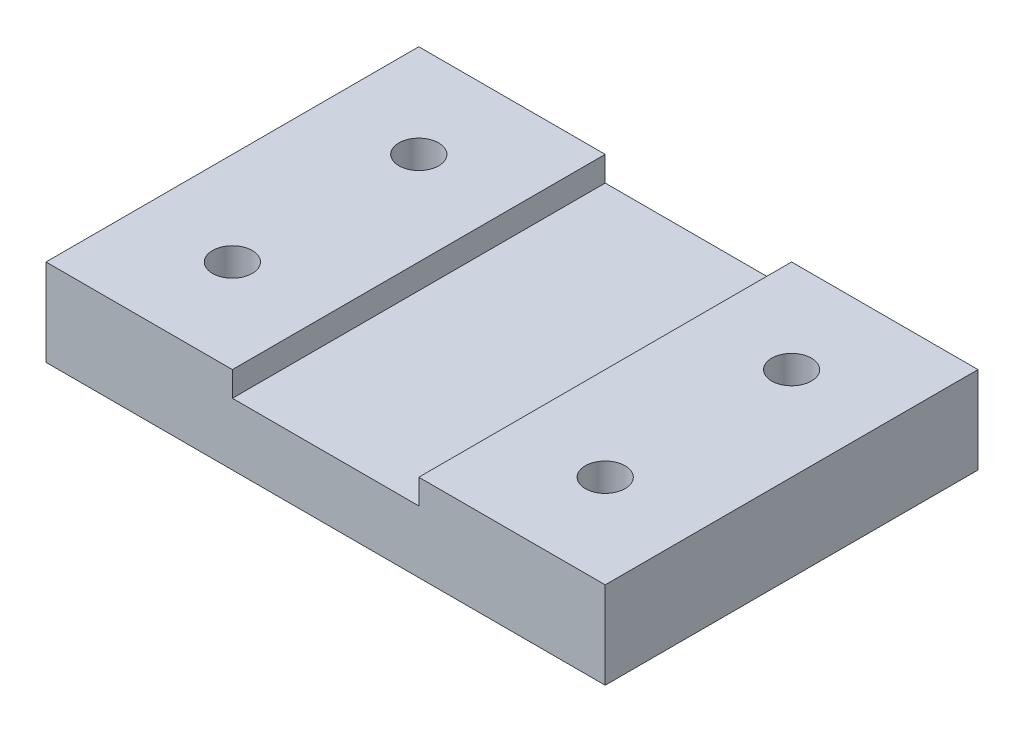
ISO-10303-21;
HEADER;
FILE_DESCRIPTION(('STEP AP214'),'2;1');
FILE_NAME('part.step','',(''),(''),'','','');
FILE_SCHEMA(('AUTOMOTIVE_DESIGN { 1 0 10303 214 1 1 1 1 }'));
ENDSEC;
DATA;
#1=APPLICATION_CONTEXT('core data for automotive mechanical design processes');
#2=APPLICATION_PROTOCOL_DEFINITION('international standard','automotive_design',2000,#1);
#3=PRODUCT_CONTEXT('',#1,'mechanical');
#4=PRODUCT('Part','Part','',(#3));
#5=PRODUCT_RELATED_PRODUCT_CATEGORY('part','',(#4));
#6=PRODUCT_DEFINITION_FORMATION('','',#4);
#7=PRODUCT_DEFINITION_CONTEXT('part definition',#1,'design');
#8=PRODUCT_DEFINITION('design','',#6,#7);
#9=PRODUCT_DEFINITION_SHAPE('','',#8);
#10=(LENGTH_UNIT() NAMED_UNIT(*) SI_UNIT(.MILLI.,.METRE.));
#11=(NAMED_UNIT(*) PLANE_ANGLE_UNIT() SI_UNIT($,.RADIAN.));
#12=(NAMED_UNIT(*) SI_UNIT($,.STERADIAN.) SOLID_ANGLE_UNIT());
#13=UNCERTAINTY_MEASURE_WITH_UNIT(LENGTH_MEASURE(1.E-05),#10,'distance_accuracy_value','');
#14=(GEOMETRIC_REPRESENTATION_CONTEXT(3) GLOBAL_UNCERTAINTY_ASSIGNED_CONTEXT((#13)) GLOBAL_UNIT_ASSIGNED_CONTEXT((#10,
#11,#12)) REPRESENTATION_CONTEXT('',''));
#15=CARTESIAN_POINT('',(0.,0.,0.));
#16=DIRECTION('',(0.,0.,1.));
#17=DIRECTION('',(1.,0.,0.));
#18=AXIS2_PLACEMENT_3D('',#15,#16,#17);
#19=CARTESIAN_POINT('',(0.,7.,-15.));
#20=DIRECTION('',(0.,0.,1.));
#21=DIRECTION('',(1.,0.,0.));
#22=AXIS2_PLACEMENT_3D('',#19,#20,#21);
#23=PLANE('',#22);
#24=DIRECTION('',(-1.,0.,0.));
#25=VECTOR('',#24,1.);
#26=CARTESIAN_POINT('',(0.,0.,-15.));
#27=LINE('',#26,#25);
#28=CARTESIAN_POINT('',(22.5,0.,-15.));
#29=VERTEX_POINT('',#28);
#30=CARTESIAN_POINT('',(-22.5,0.,-15.));
#31=VERTEX_POINT('',#30);
#32=EDGE_CURVE('E180',#29,#31,#27,.T.);
#33=ORIENTED_EDGE('',*,*,#32,.T.);
#34=DIRECTION('',(0.,-1.,0.));
#35=VECTOR('',#34,1.);
#36=CARTESIAN_POINT('',(-22.5,7.,-15.));
#37=LINE('',#36,#35);
#38=CARTESIAN_POINT('',(-22.5,7.,-15.));
#39=VERTEX_POINT('',#38);
#40=EDGE_CURVE('E11',#39,#31,#37,.T.);
#41=ORIENTED_EDGE('',*,*,#40,.F.);
#42=DIRECTION('',(-1.,0.,0.));
#43=VECTOR('',#42,1.);
#44=CARTESIAN_POINT('',(0.,7.,-15.));
#45=LINE('',#44,#43);
#46=CARTESIAN_POINT('',(-7.5,7.,-15.));
#47=VERTEX_POINT('',#46);
#48=EDGE_CURVE('E168',#47,#39,#45,.T.);
#49=ORIENTED_EDGE('',*,*,#48,.F.);
#50=DIRECTION('',(0.,-1.,0.));
#51=VECTOR('',#50,1.);
#52=CARTESIAN_POINT('',(-7.5,7.,-15.));
#53=LINE('',#52,#51);
#54=CARTESIAN_POINT('',(-7.5,5.,-15.));
#55=VERTEX_POINT('',#54);
#56=EDGE_CURVE('E174',#47,#55,#53,.T.);
#57=ORIENTED_EDGE('',*,*,#56,.T.);
#58=DIRECTION('',(1.,0.,0.));
#59=VECTOR('',#58,1.);
#60=CARTESIAN_POINT('',(0.,5.,-15.));
#61=LINE('',#60,#59);
#62=CARTESIAN_POINT('',(7.5,5.,-15.));
#63=VERTEX_POINT('',#62);
#64=EDGE_CURVE('E48',#55,#63,#61,.T.);
#65=ORIENTED_EDGE('',*,*,#64,.T.);
#66=DIRECTION('',(0.,-1.,0.));
#67=VECTOR('',#66,1.);
#68=CARTESIAN_POINT('',(7.5,7.,-15.));
#69=LINE('',#68,#67);
#70=CARTESIAN_POINT('',(7.5,7.,-15.));
#71=VERTEX_POINT('',#70);
#72=EDGE_CURVE('E120',#71,#63,#69,.T.);
#73=ORIENTED_EDGE('',*,*,#72,.F.);
#74=DIRECTION('',(1.,0.,0.));
#75=VECTOR('',#74,1.);
#76=CARTESIAN_POINT('',(0.,7.,-15.));
#77=LINE('',#76,#75);
#78=CARTESIAN_POINT('',(22.5,7.,-15.));
#79=VERTEX_POINT('',#78);
#80=EDGE_CURVE('E126',#71,#79,#77,.T.);
#81=ORIENTED_EDGE('',*,*,#80,.T.);
#82=DIRECTION('',(0.,-1.,0.));
#83=VECTOR('',#82,1.);
#84=CARTESIAN_POINT('',(22.5,7.,-15.));
#85=LINE('',#84,#83);
#86=EDGE_CURVE('E109',#79,#29,#85,.T.);
#87=ORIENTED_EDGE('',*,*,#86,.T.);
#88=EDGE_LOOP('',(#33,#41,#49,#57,#65,#73,#81,#87));
#89=FACE_BOUND('',#88,.T.);
#90=ADVANCED_FACE('F33',(#89),#23,.F.);
#91=CARTESIAN_POINT('',(-22.5,7.,0.));
#92=DIRECTION('',(1.,0.,0.));
#93=DIRECTION('',(0.,0.,-1.));
#94=AXIS2_PLACEMENT_3D('',#91,#92,#93);
#95=PLANE('',#94);
#96=DIRECTION('',(0.,0.,1.));
#97=VECTOR('',#96,1.);
#98=CARTESIAN_POINT('',(-22.5,0.,0.));
#99=LINE('',#98,#97);
#100=CARTESIAN_POINT('',(-22.5,0.,15.));
#101=VERTEX_POINT('',#100);
#102=EDGE_CURVE('E182',#31,#101,#99,.T.);
#103=ORIENTED_EDGE('',*,*,#102,.T.);
#104=DIRECTION('',(0.,-1.,0.));
#105=VECTOR('',#104,1.);
#106=CARTESIAN_POINT('',(-22.5,7.,15.));
#107=LINE('',#106,#105);
#108=CARTESIAN_POINT('',(-22.5,7.,15.));
#109=VERTEX_POINT('',#108);
#110=EDGE_CURVE('E41',#109,#101,#107,.T.);
#111=ORIENTED_EDGE('',*,*,#110,.F.);
#112=DIRECTION('',(0.,0.,1.));
#113=VECTOR('',#112,1.);
#114=CARTESIAN_POINT('',(-22.5,7.,0.));
#115=LINE('',#114,#113);
#116=EDGE_CURVE('E79',#39,#109,#115,.T.);
#117=ORIENTED_EDGE('',*,*,#116,.F.);
#118=ORIENTED_EDGE('',*,*,#40,.T.);
#119=EDGE_LOOP('',(#103,#111,#117,#118));
#120=FACE_BOUND('',#119,.T.);
#121=ADVANCED_FACE('F210',(#120),#95,.F.);
#122=CARTESIAN_POINT('',(0.,7.,15.));
#123=DIRECTION('',(0.,0.,1.));
#124=DIRECTION('',(1.,0.,0.));
#125=AXIS2_PLACEMENT_3D('',#122,#123,#124);
#126=PLANE('',#125);
#127=DIRECTION('',(-1.,0.,0.));
#128=VECTOR('',#127,1.);
#129=CARTESIAN_POINT('',(0.,0.,15.));
#130=LINE('',#129,#128);
#131=CARTESIAN_POINT('',(22.5,0.,15.));
#132=VERTEX_POINT('',#131);
#133=EDGE_CURVE('E165',#132,#101,#130,.T.);
#134=ORIENTED_EDGE('',*,*,#133,.F.);
#135=DIRECTION('',(0.,-1.,0.));
#136=VECTOR('',#135,1.);
#137=CARTESIAN_POINT('',(22.5,7.,15.));
#138=LINE('',#137,#136);
#139=CARTESIAN_POINT('',(22.5,7.,15.));
#140=VERTEX_POINT('',#139);
#141=EDGE_CURVE('E139',#140,#132,#138,.T.);
#142=ORIENTED_EDGE('',*,*,#141,.F.);
#143=DIRECTION('',(1.,0.,0.));
#144=VECTOR('',#143,1.);
#145=CARTESIAN_POINT('',(0.,7.,15.));
#146=LINE('',#145,#144);
#147=CARTESIAN_POINT('',(7.5,7.,15.));
#148=VERTEX_POINT('',#147);
#149=EDGE_CURVE('E129',#148,#140,#146,.T.);
#150=ORIENTED_EDGE('',*,*,#149,.F.);
#151=DIRECTION('',(0.,-1.,0.));
#152=VECTOR('',#151,1.);
#153=CARTESIAN_POINT('',(7.5,7.,15.));
#154=LINE('',#153,#152);
#155=CARTESIAN_POINT('',(7.5,5.,15.));
#156=VERTEX_POINT('',#155);
#157=EDGE_CURVE('E149',#148,#156,#154,.T.);
#158=ORIENTED_EDGE('',*,*,#157,.T.);
#159=DIRECTION('',(1.,0.,0.));
#160=VECTOR('',#159,1.);
#161=CARTESIAN_POINT('',(0.,5.,15.));
#162=LINE('',#161,#160);
#163=CARTESIAN_POINT('',(-7.5,5.,15.));
#164=VERTEX_POINT('',#163);
#165=EDGE_CURVE('E119',#164,#156,#162,.T.);
#166=ORIENTED_EDGE('',*,*,#165,.F.);
#167=DIRECTION('',(0.,-1.,0.));
#168=VECTOR('',#167,1.);
#169=CARTESIAN_POINT('',(-7.5,7.,15.));
#170=LINE('',#169,#168);
#171=CARTESIAN_POINT('',(-7.5,7.,15.));
#172=VERTEX_POINT('',#171);
#173=EDGE_CURVE('E188',#172,#164,#170,.T.);
#174=ORIENTED_EDGE('',*,*,#173,.F.);
#175=DIRECTION('',(-1.,0.,0.));
#176=VECTOR('',#175,1.);
#177=CARTESIAN_POINT('',(0.,7.,15.));
#178=LINE('',#177,#176);
#179=EDGE_CURVE('E171',#172,#109,#178,.T.);
#180=ORIENTED_EDGE('',*,*,#179,.T.);
#181=ORIENTED_EDGE('',*,*,#110,.T.);
#182=EDGE_LOOP('',(#134,#142,#150,#158,#166,#174,#180,#181));
#183=FACE_BOUND('',#182,.T.);
#184=ADVANCED_FACE('F192',(#183),#126,.T.);
#185=CARTESIAN_POINT('',(-15.,7.,-7.5));
#186=DIRECTION('',(0.,-1.,0.));
#187=DIRECTION('',(0.,0.,-1.));
#188=AXIS2_PLACEMENT_3D('',#185,#186,#187);
#189=CYLINDRICAL_SURFACE('',#188,1.6);
#190=CARTESIAN_POINT('',(-15.,7.,-7.5));
#191=DIRECTION('',(0.,1.,0.));
#192=DIRECTION('',(0.,0.,1.));
#193=AXIS2_PLACEMENT_3D('',#190,#191,#192);
#194=CIRCLE('',#193,1.6);
#195=CARTESIAN_POINT('',(-15.,7.,-5.9));
#196=VERTEX_POINT('',#195);
#197=EDGE_CURVE('E164',#196,#196,#194,.T.);
#198=ORIENTED_EDGE('',*,*,#197,.T.);
#199=EDGE_LOOP('',(#198));
#200=FACE_BOUND('',#199,.T.);
#201=CARTESIAN_POINT('',(-15.,0.,-7.5));
#202=DIRECTION('',(0.,1.,0.));
#203=DIRECTION('',(0.,0.,1.));
#204=AXIS2_PLACEMENT_3D('',#201,#202,#203);
#205=CIRCLE('',#204,1.6);
#206=CARTESIAN_POINT('',(-15.,0.,-5.9));
#207=VERTEX_POINT('',#206);
#208=EDGE_CURVE('E177',#207,#207,#205,.T.);
#209=ORIENTED_EDGE('',*,*,#208,.F.);
#210=EDGE_LOOP('',(#209));
#211=FACE_BOUND('',#210,.T.);
#212=ADVANCED_FACE('F217',(#200,#211),#189,.F.);
#213=CARTESIAN_POINT('',(-15.,7.,7.5));
#214=DIRECTION('',(0.,-1.,0.));
#215=DIRECTION('',(0.,0.,-1.));
#216=AXIS2_PLACEMENT_3D('',#213,#214,#215);
#217=CYLINDRICAL_SURFACE('',#216,1.6);
#218=CARTESIAN_POINT('',(-15.,7.,7.5));
#219=DIRECTION('',(0.,1.,0.));
#220=DIRECTION('',(0.,0.,1.));
#221=AXIS2_PLACEMENT_3D('',#218,#219,#220);
#222=CIRCLE('',#221,1.6);
#223=CARTESIAN_POINT('',(-15.,7.,9.1));
#224=VERTEX_POINT('',#223);
#225=EDGE_CURVE('E161',#224,#224,#222,.T.);
#226=ORIENTED_EDGE('',*,*,#225,.T.);
#227=EDGE_LOOP('',(#226));
#228=FACE_BOUND('',#227,.T.);
#229=CARTESIAN_POINT('',(-15.,0.,7.5));
#230=DIRECTION('',(0.,1.,0.));
#231=DIRECTION('',(0.,0.,1.));
#232=AXIS2_PLACEMENT_3D('',#229,#230,#231);
#233=CIRCLE('',#232,1.6);
#234=CARTESIAN_POINT('',(-15.,0.,9.1));
#235=VERTEX_POINT('',#234);
#236=EDGE_CURVE('E160',#235,#235,#233,.T.);
#237=ORIENTED_EDGE('',*,*,#236,.F.);
#238=EDGE_LOOP('',(#237));
#239=FACE_BOUND('',#238,.T.);
#240=ADVANCED_FACE('F35',(#228,#239),#217,.F.);
#241=CARTESIAN_POINT('',(-7.5,7.,0.));
#242=DIRECTION('',(-1.,0.,0.));
#243=DIRECTION('',(0.,0.,1.));
#244=AXIS2_PLACEMENT_3D('',#241,#242,#243);
#245=PLANE('',#244);
#246=ORIENTED_EDGE('',*,*,#173,.T.);
#247=DIRECTION('',(0.,0.,-1.));
#248=VECTOR('',#247,1.);
#249=CARTESIAN_POINT('',(-7.5,5.,0.));
#250=LINE('',#249,#248);
#251=EDGE_CURVE('E158',#164,#55,#250,.T.);
#252=ORIENTED_EDGE('',*,*,#251,.T.);
#253=ORIENTED_EDGE('',*,*,#56,.F.);
#254=DIRECTION('',(0.,0.,-1.));
#255=VECTOR('',#254,1.);
#256=CARTESIAN_POINT('',(-7.5,7.,0.));
#257=LINE('',#256,#255);
#258=EDGE_CURVE('E57',#172,#47,#257,.T.);
#259=ORIENTED_EDGE('',*,*,#258,.F.);
#260=EDGE_LOOP('',(#246,#252,#253,#259));
#261=FACE_BOUND('',#260,.T.);
#262=ADVANCED_FACE('F191',(#261),#245,.F.);
#263=CARTESIAN_POINT('',(0.,7.,0.));
#264=DIRECTION('',(0.,1.,0.));
#265=DIRECTION('',(0.,0.,1.));
#266=AXIS2_PLACEMENT_3D('',#263,#264,#265);
#267=PLANE('',#266);
#268=ORIENTED_EDGE('',*,*,#225,.F.);
#269=EDGE_LOOP('',(#268));
#270=FACE_BOUND('',#269,.T.);
#271=ORIENTED_EDGE('',*,*,#197,.F.);
#272=EDGE_LOOP('',(#271));
#273=FACE_BOUND('',#272,.T.);
#274=ORIENTED_EDGE('',*,*,#48,.T.);
#275=ORIENTED_EDGE('',*,*,#116,.T.);
#276=ORIENTED_EDGE('',*,*,#179,.F.);
#277=ORIENTED_EDGE('',*,*,#258,.T.);
#278=EDGE_LOOP('',(#274,#275,#276,#277));
#279=FACE_BOUND('',#278,.T.);
#280=ADVANCED_FACE('F204',(#270,#273,#279),#267,.T.);
#281=CARTESIAN_POINT('',(0.,0.,0.));
#282=DIRECTION('',(0.,1.,0.));
#283=DIRECTION('',(0.,0.,1.));
#284=AXIS2_PLACEMENT_3D('',#281,#282,#283);
#285=PLANE('',#284);
#286=ORIENTED_EDGE('',*,*,#236,.T.);
#287=EDGE_LOOP('',(#286));
#288=FACE_BOUND('',#287,.T.);
#289=ORIENTED_EDGE('',*,*,#208,.T.);
#290=EDGE_LOOP('',(#289));
#291=FACE_BOUND('',#290,.T.);
#292=ORIENTED_EDGE('',*,*,#32,.F.);
#293=DIRECTION('',(0.,0.,1.));
#294=VECTOR('',#293,1.);
#295=CARTESIAN_POINT('',(22.5,0.,0.));
#296=LINE('',#295,#294);
#297=EDGE_CURVE('E115',#29,#132,#296,.T.);
#298=ORIENTED_EDGE('',*,*,#297,.T.);
#299=ORIENTED_EDGE('',*,*,#133,.T.);
#300=ORIENTED_EDGE('',*,*,#102,.F.);
#301=EDGE_LOOP('',(#292,#298,#299,#300));
#302=FACE_BOUND('',#301,.T.);
#303=CARTESIAN_POINT('',(15.,0.,7.5));
#304=DIRECTION('',(0.,1.,0.));
#305=DIRECTION('',(0.,0.,1.));
#306=AXIS2_PLACEMENT_3D('',#303,#304,#305);
#307=CIRCLE('',#306,1.6);
#308=CARTESIAN_POINT('',(15.,0.,9.1));
#309=VERTEX_POINT('',#308);
#310=EDGE_CURVE('E140',#309,#309,#307,.T.);
#311=ORIENTED_EDGE('',*,*,#310,.T.);
#312=EDGE_LOOP('',(#311));
#313=FACE_BOUND('',#312,.T.);
#314=CARTESIAN_POINT('',(15.,0.,-7.5));
#315=DIRECTION('',(0.,1.,0.));
#316=DIRECTION('',(0.,0.,1.));
#317=AXIS2_PLACEMENT_3D('',#314,#315,#316);
#318=CIRCLE('',#317,1.6);
#319=CARTESIAN_POINT('',(15.,0.,-5.9));
#320=VERTEX_POINT('',#319);
#321=EDGE_CURVE('E143',#320,#320,#318,.T.);
#322=ORIENTED_EDGE('',*,*,#321,.T.);
#323=EDGE_LOOP('',(#322));
#324=FACE_BOUND('',#323,.T.);
#325=ADVANCED_FACE('F196',(#288,#291,#302,#313,#324),#285,.F.);
#326=CARTESIAN_POINT('',(0.,5.,0.));
#327=DIRECTION('',(0.,1.,0.));
#328=DIRECTION('',(0.,0.,1.));
#329=AXIS2_PLACEMENT_3D('',#326,#327,#328);
#330=PLANE('',#329);
#331=ORIENTED_EDGE('',*,*,#165,.T.);
#332=DIRECTION('',(0.,0.,-1.));
#333=VECTOR('',#332,1.);
#334=CARTESIAN_POINT('',(7.5,5.,0.));
#335=LINE('',#334,#333);
#336=EDGE_CURVE('E155',#156,#63,#335,.T.);
#337=ORIENTED_EDGE('',*,*,#336,.T.);
#338=ORIENTED_EDGE('',*,*,#64,.F.);
#339=ORIENTED_EDGE('',*,*,#251,.F.);
#340=EDGE_LOOP('',(#331,#337,#338,#339));
#341=FACE_BOUND('',#340,.T.);
#342=ADVANCED_FACE('F193',(#341),#330,.T.);
#343=CARTESIAN_POINT('',(7.5,7.,0.));
#344=DIRECTION('',(-1.,0.,0.));
#345=DIRECTION('',(0.,0.,1.));
#346=AXIS2_PLACEMENT_3D('',#343,#344,#345);
#347=PLANE('',#346);
#348=ORIENTED_EDGE('',*,*,#336,.F.);
#349=ORIENTED_EDGE('',*,*,#157,.F.);
#350=DIRECTION('',(0.,0.,-1.));
#351=VECTOR('',#350,1.);
#352=CARTESIAN_POINT('',(7.5,7.,0.));
#353=LINE('',#352,#351);
#354=EDGE_CURVE('E133',#148,#71,#353,.T.);
#355=ORIENTED_EDGE('',*,*,#354,.T.);
#356=ORIENTED_EDGE('',*,*,#72,.T.);
#357=EDGE_LOOP('',(#348,#349,#355,#356));
#358=FACE_BOUND('',#357,.T.);
#359=ADVANCED_FACE('F195',(#358),#347,.T.);
#360=CARTESIAN_POINT('',(22.5,7.,0.));
#361=DIRECTION('',(1.,0.,0.));
#362=DIRECTION('',(0.,0.,-1.));
#363=AXIS2_PLACEMENT_3D('',#360,#361,#362);
#364=PLANE('',#363);
#365=ORIENTED_EDGE('',*,*,#297,.F.);
#366=ORIENTED_EDGE('',*,*,#86,.F.);
#367=DIRECTION('',(0.,0.,1.));
#368=VECTOR('',#367,1.);
#369=CARTESIAN_POINT('',(22.5,7.,0.));
#370=LINE('',#369,#368);
#371=EDGE_CURVE('E113',#79,#140,#370,.T.);
#372=ORIENTED_EDGE('',*,*,#371,.T.);
#373=ORIENTED_EDGE('',*,*,#141,.T.);
#374=EDGE_LOOP('',(#365,#366,#372,#373));
#375=FACE_BOUND('',#374,.T.);
#376=ADVANCED_FACE('F111',(#375),#364,.T.);
#377=CARTESIAN_POINT('',(15.,7.,-7.5));
#378=DIRECTION('',(0.,-1.,0.));
#379=DIRECTION('',(0.,0.,-1.));
#380=AXIS2_PLACEMENT_3D('',#377,#378,#379);
#381=CYLINDRICAL_SURFACE('',#380,1.6);
#382=CARTESIAN_POINT('',(15.,7.,-7.5));
#383=DIRECTION('',(0.,1.,0.));
#384=DIRECTION('',(0.,0.,1.));
#385=AXIS2_PLACEMENT_3D('',#382,#383,#384);
#386=CIRCLE('',#385,1.6);
#387=CARTESIAN_POINT('',(15.,7.,-5.9));
#388=VERTEX_POINT('',#387);
#389=EDGE_CURVE('E131',#388,#388,#386,.T.);
#390=ORIENTED_EDGE('',*,*,#389,.T.);
#391=EDGE_LOOP('',(#390));
#392=FACE_BOUND('',#391,.T.);
#393=ORIENTED_EDGE('',*,*,#321,.F.);
#394=EDGE_LOOP('',(#393));
#395=FACE_BOUND('',#394,.T.);
#396=ADVANCED_FACE('F235',(#392,#395),#381,.F.);
#397=CARTESIAN_POINT('',(15.,7.,7.5));
#398=DIRECTION('',(0.,-1.,0.));
#399=DIRECTION('',(0.,0.,-1.));
#400=AXIS2_PLACEMENT_3D('',#397,#398,#399);
#401=CYLINDRICAL_SURFACE('',#400,1.6);
#402=CARTESIAN_POINT('',(15.,7.,7.5));
#403=DIRECTION('',(0.,1.,0.));
#404=DIRECTION('',(0.,0.,1.));
#405=AXIS2_PLACEMENT_3D('',#402,#403,#404);
#406=CIRCLE('',#405,1.6);
#407=CARTESIAN_POINT('',(15.,7.,9.1));
#408=VERTEX_POINT('',#407);
#409=EDGE_CURVE('E147',#408,#408,#406,.T.);
#410=ORIENTED_EDGE('',*,*,#409,.T.);
#411=EDGE_LOOP('',(#410));
#412=FACE_BOUND('',#411,.T.);
#413=ORIENTED_EDGE('',*,*,#310,.F.);
#414=EDGE_LOOP('',(#413));
#415=FACE_BOUND('',#414,.T.);
#416=ADVANCED_FACE('F237',(#412,#415),#401,.F.);
#417=CARTESIAN_POINT('',(0.,7.,0.));
#418=DIRECTION('',(0.,1.,0.));
#419=DIRECTION('',(0.,0.,1.));
#420=AXIS2_PLACEMENT_3D('',#417,#418,#419);
#421=PLANE('',#420);
#422=ORIENTED_EDGE('',*,*,#409,.F.);
#423=EDGE_LOOP('',(#422));
#424=FACE_BOUND('',#423,.T.);
#425=ORIENTED_EDGE('',*,*,#389,.F.);
#426=EDGE_LOOP('',(#425));
#427=FACE_BOUND('',#426,.T.);
#428=ORIENTED_EDGE('',*,*,#371,.F.);
#429=ORIENTED_EDGE('',*,*,#80,.F.);
#430=ORIENTED_EDGE('',*,*,#354,.F.);
#431=ORIENTED_EDGE('',*,*,#149,.T.);
#432=EDGE_LOOP('',(#428,#429,#430,#431));
#433=FACE_BOUND('',#432,.T.);
#434=ADVANCED_FACE('F124',(#424,#427,#433),#421,.T.);
#435=CLOSED_SHELL('',(#90,#121,#184,#212,#240,#262,#280,#325,#342,#359,#376,#396,#416,#434));
#436=MANIFOLD_SOLID_BREP('B2',#435);
#437=ADVANCED_BREP_SHAPE_REPRESENTATION('',(#18,#436),#14);
#438=SHAPE_DEFINITION_REPRESENTATION(#9,#437);
ENDSEC;
END-ISO-10303-21;
